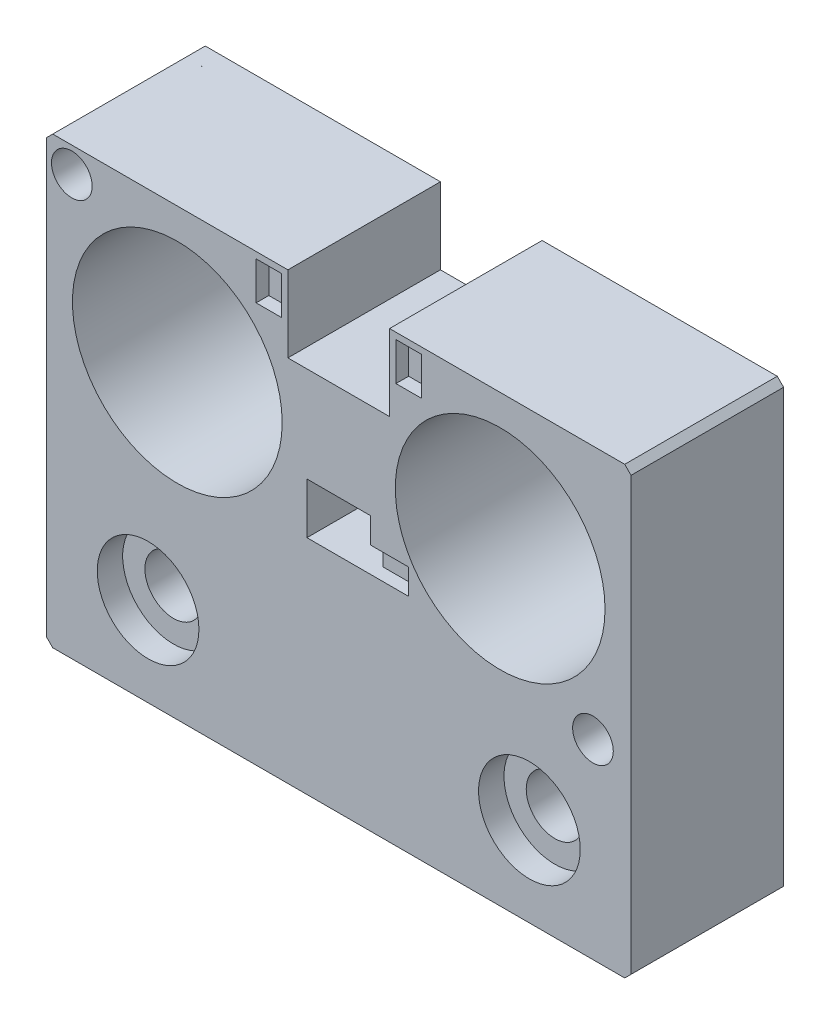
ISO-10303-21;
HEADER;
FILE_DESCRIPTION(('STEP AP214'),'2;1');
FILE_NAME('part.step','',(''),(''),'','','');
FILE_SCHEMA(('AUTOMOTIVE_DESIGN { 1 0 10303 214 1 1 1 1 }'));
ENDSEC;
DATA;
#1=APPLICATION_CONTEXT('core data for automotive mechanical design processes');
#2=APPLICATION_PROTOCOL_DEFINITION('international standard','automotive_design',2000,#1);
#3=PRODUCT_CONTEXT('',#1,'mechanical');
#4=PRODUCT('Part','Part','',(#3));
#5=PRODUCT_RELATED_PRODUCT_CATEGORY('part','',(#4));
#6=PRODUCT_DEFINITION_FORMATION('','',#4);
#7=PRODUCT_DEFINITION_CONTEXT('part definition',#1,'design');
#8=PRODUCT_DEFINITION('design','',#6,#7);
#9=PRODUCT_DEFINITION_SHAPE('','',#8);
#10=(LENGTH_UNIT() NAMED_UNIT(*) SI_UNIT(.MILLI.,.METRE.));
#11=(NAMED_UNIT(*) PLANE_ANGLE_UNIT() SI_UNIT($,.RADIAN.));
#12=(NAMED_UNIT(*) SI_UNIT($,.STERADIAN.) SOLID_ANGLE_UNIT());
#13=UNCERTAINTY_MEASURE_WITH_UNIT(LENGTH_MEASURE(1.E-05),#10,'distance_accuracy_value','');
#14=(GEOMETRIC_REPRESENTATION_CONTEXT(3) GLOBAL_UNCERTAINTY_ASSIGNED_CONTEXT((#13)) GLOBAL_UNIT_ASSIGNED_CONTEXT((#10,
#11,#12)) REPRESENTATION_CONTEXT('',''));
#15=CARTESIAN_POINT('',(0.,0.,0.));
#16=DIRECTION('',(0.,0.,1.));
#17=DIRECTION('',(1.,0.,0.));
#18=AXIS2_PLACEMENT_3D('',#15,#16,#17);
#19=CARTESIAN_POINT('',(-15.,-18.,12.));
#20=DIRECTION('',(0.,0.,-1.));
#21=DIRECTION('',(-1.,0.,0.));
#22=AXIS2_PLACEMENT_3D('',#19,#20,#21);
#23=CYLINDRICAL_SURFACE('',#22,2.25);
#24=CARTESIAN_POINT('',(-15.,-18.,0.));
#25=DIRECTION('',(0.,0.,-1.));
#26=DIRECTION('',(-1.,0.,0.));
#27=AXIS2_PLACEMENT_3D('',#24,#25,#26);
#28=CIRCLE('',#27,2.25);
#29=CARTESIAN_POINT('',(-17.25,-18.,0.));
#30=VERTEX_POINT('',#29);
#31=EDGE_CURVE('E908',#30,#30,#28,.T.);
#32=ORIENTED_EDGE('',*,*,#31,.T.);
#33=EDGE_LOOP('',(#32));
#34=FACE_BOUND('',#33,.T.);
#35=CARTESIAN_POINT('',(-15.,-18.,10.));
#36=DIRECTION('',(0.,0.,1.));
#37=DIRECTION('',(1.,0.,0.));
#38=AXIS2_PLACEMENT_3D('',#35,#36,#37);
#39=CIRCLE('',#38,2.25);
#40=CARTESIAN_POINT('',(-12.75,-18.,10.));
#41=VERTEX_POINT('',#40);
#42=EDGE_CURVE('E409',#41,#41,#39,.F.);
#43=ORIENTED_EDGE('',*,*,#42,.F.);
#44=EDGE_LOOP('',(#43));
#45=FACE_BOUND('',#44,.T.);
#46=ADVANCED_FACE('F35',(#34,#45),#23,.F.);
#47=CARTESIAN_POINT('',(15.,-18.,12.));
#48=DIRECTION('',(0.,0.,-1.));
#49=DIRECTION('',(-1.,0.,0.));
#50=AXIS2_PLACEMENT_3D('',#47,#48,#49);
#51=CYLINDRICAL_SURFACE('',#50,2.25000000000001);
#52=CARTESIAN_POINT('',(15.,-18.,0.));
#53=DIRECTION('',(0.,0.,-1.));
#54=DIRECTION('',(-1.,0.,0.));
#55=AXIS2_PLACEMENT_3D('',#52,#53,#54);
#56=CIRCLE('',#55,2.25000000000001);
#57=CARTESIAN_POINT('',(12.75,-18.,0.));
#58=VERTEX_POINT('',#57);
#59=EDGE_CURVE('E911',#58,#58,#56,.T.);
#60=ORIENTED_EDGE('',*,*,#59,.T.);
#61=EDGE_LOOP('',(#60));
#62=FACE_BOUND('',#61,.T.);
#63=CARTESIAN_POINT('',(15.,-18.,10.));
#64=DIRECTION('',(0.,0.,1.));
#65=DIRECTION('',(1.,0.,0.));
#66=AXIS2_PLACEMENT_3D('',#63,#64,#65);
#67=CIRCLE('',#66,2.25000000000001);
#68=CARTESIAN_POINT('',(17.25,-18.,10.));
#69=VERTEX_POINT('',#68);
#70=EDGE_CURVE('E406',#69,#69,#67,.F.);
#71=ORIENTED_EDGE('',*,*,#70,.F.);
#72=EDGE_LOOP('',(#71));
#73=FACE_BOUND('',#72,.T.);
#74=ADVANCED_FACE('F506',(#62,#73),#51,.F.);
#75=CARTESIAN_POINT('',(-23.,10.,12.));
#76=DIRECTION('',(0.,-1.,0.));
#77=DIRECTION('',(0.,0.,-1.));
#78=AXIS2_PLACEMENT_3D('',#75,#76,#77);
#79=PLANE('',#78);
#80=DIRECTION('',(-1.,0.,0.));
#81=VECTOR('',#80,1.);
#82=CARTESIAN_POINT('',(-23.,10.,12.));
#83=LINE('',#82,#81);
#84=CARTESIAN_POINT('',(22.5,10.,12.));
#85=VERTEX_POINT('',#84);
#86=CARTESIAN_POINT('',(4.00000000000001,10.,12.));
#87=VERTEX_POINT('',#86);
#88=EDGE_CURVE('E391',#85,#87,#83,.T.);
#89=ORIENTED_EDGE('',*,*,#88,.F.);
#90=DIRECTION('',(0.,0.,-1.));
#91=VECTOR('',#90,1.);
#92=CARTESIAN_POINT('',(22.5,10.,12.));
#93=LINE('',#92,#91);
#94=CARTESIAN_POINT('',(22.5,10.,0.));
#95=VERTEX_POINT('',#94);
#96=EDGE_CURVE('E427',#85,#95,#93,.T.);
#97=ORIENTED_EDGE('',*,*,#96,.T.);
#98=DIRECTION('',(-1.,0.,0.));
#99=VECTOR('',#98,1.);
#100=CARTESIAN_POINT('',(-23.,10.,0.));
#101=LINE('',#100,#99);
#102=CARTESIAN_POINT('',(4.00000000000001,10.,0.));
#103=VERTEX_POINT('',#102);
#104=EDGE_CURVE('E398',#95,#103,#101,.T.);
#105=ORIENTED_EDGE('',*,*,#104,.T.);
#106=DIRECTION('',(0.,0.,1.));
#107=VECTOR('',#106,1.);
#108=CARTESIAN_POINT('',(4.00000000000001,10.,0.));
#109=LINE('',#108,#107);
#110=EDGE_CURVE('E358',#103,#87,#109,.T.);
#111=ORIENTED_EDGE('',*,*,#110,.T.);
#112=EDGE_LOOP('',(#89,#97,#105,#111));
#113=FACE_BOUND('',#112,.T.);
#114=ADVANCED_FACE('F487',(#113),#79,.F.);
#115=CARTESIAN_POINT('',(23.,-10.,12.));
#116=DIRECTION('',(-1.,0.,0.));
#117=DIRECTION('',(0.,0.,1.));
#118=AXIS2_PLACEMENT_3D('',#115,#116,#117);
#119=PLANE('',#118);
#120=DIRECTION('',(0.,1.,0.));
#121=VECTOR('',#120,1.);
#122=CARTESIAN_POINT('',(23.,-10.,12.));
#123=LINE('',#122,#121);
#124=CARTESIAN_POINT('',(23.,-24.5,12.));
#125=VERTEX_POINT('',#124);
#126=CARTESIAN_POINT('',(23.,9.50000000000001,12.));
#127=VERTEX_POINT('',#126);
#128=EDGE_CURVE('E387',#125,#127,#123,.T.);
#129=ORIENTED_EDGE('',*,*,#128,.F.);
#130=DIRECTION('',(0.,0.,-1.));
#131=VECTOR('',#130,1.);
#132=CARTESIAN_POINT('',(23.,-24.5,0.));
#133=LINE('',#132,#131);
#134=CARTESIAN_POINT('',(23.,-24.5,0.));
#135=VERTEX_POINT('',#134);
#136=EDGE_CURVE('E11',#125,#135,#133,.T.);
#137=ORIENTED_EDGE('',*,*,#136,.T.);
#138=DIRECTION('',(0.,1.,0.));
#139=VECTOR('',#138,1.);
#140=CARTESIAN_POINT('',(23.,-10.,0.));
#141=LINE('',#140,#139);
#142=CARTESIAN_POINT('',(23.,9.50000000000001,0.));
#143=VERTEX_POINT('',#142);
#144=EDGE_CURVE('E378',#135,#143,#141,.T.);
#145=ORIENTED_EDGE('',*,*,#144,.T.);
#146=DIRECTION('',(0.,0.,1.));
#147=VECTOR('',#146,1.);
#148=CARTESIAN_POINT('',(23.,9.50000000000001,12.));
#149=LINE('',#148,#147);
#150=EDGE_CURVE('E430',#143,#127,#149,.T.);
#151=ORIENTED_EDGE('',*,*,#150,.T.);
#152=EDGE_LOOP('',(#129,#137,#145,#151));
#153=FACE_BOUND('',#152,.T.);
#154=ADVANCED_FACE('F498',(#153),#119,.F.);
#155=CARTESIAN_POINT('',(-3.99999999999999,10.,0.));
#156=VERTEX_POINT('',#155);
#157=CARTESIAN_POINT('',(-22.5,10.,0.));
#158=VERTEX_POINT('',#157);
#159=EDGE_CURVE('E397',#156,#158,#101,.T.);
#160=ORIENTED_EDGE('',*,*,#159,.T.);
#161=DIRECTION('',(0.,0.,1.));
#162=VECTOR('',#161,1.);
#163=CARTESIAN_POINT('',(-22.5,10.,12.));
#164=LINE('',#163,#162);
#165=CARTESIAN_POINT('',(-22.5,10.,12.));
#166=VERTEX_POINT('',#165);
#167=EDGE_CURVE('E421',#158,#166,#164,.T.);
#168=ORIENTED_EDGE('',*,*,#167,.T.);
#169=CARTESIAN_POINT('',(-3.99999999999999,10.,12.));
#170=VERTEX_POINT('',#169);
#171=EDGE_CURVE('E389',#170,#166,#83,.T.);
#172=ORIENTED_EDGE('',*,*,#171,.F.);
#173=DIRECTION('',(0.,0.,1.));
#174=VECTOR('',#173,1.);
#175=CARTESIAN_POINT('',(-3.99999999999999,10.,0.));
#176=LINE('',#175,#174);
#177=EDGE_CURVE('E371',#156,#170,#176,.T.);
#178=ORIENTED_EDGE('',*,*,#177,.F.);
#179=EDGE_LOOP('',(#160,#168,#172,#178));
#180=FACE_BOUND('',#179,.T.);
#181=ADVANCED_FACE('F469',(#180),#79,.F.);
#182=CARTESIAN_POINT('',(-23.,-10.,12.));
#183=DIRECTION('',(1.,0.,0.));
#184=DIRECTION('',(0.,0.,-1.));
#185=AXIS2_PLACEMENT_3D('',#182,#183,#184);
#186=PLANE('',#185);
#187=DIRECTION('',(0.,-1.,0.));
#188=VECTOR('',#187,1.);
#189=CARTESIAN_POINT('',(-23.,-10.,0.));
#190=LINE('',#189,#188);
#191=CARTESIAN_POINT('',(-23.,9.5,0.));
#192=VERTEX_POINT('',#191);
#193=CARTESIAN_POINT('',(-23.,-24.5,0.));
#194=VERTEX_POINT('',#193);
#195=EDGE_CURVE('E390',#192,#194,#190,.T.);
#196=ORIENTED_EDGE('',*,*,#195,.T.);
#197=DIRECTION('',(0.,0.,1.));
#198=VECTOR('',#197,1.);
#199=CARTESIAN_POINT('',(-23.,-24.5,12.));
#200=LINE('',#199,#198);
#201=CARTESIAN_POINT('',(-23.,-24.5,12.));
#202=VERTEX_POINT('',#201);
#203=EDGE_CURVE('E58',#194,#202,#200,.T.);
#204=ORIENTED_EDGE('',*,*,#203,.T.);
#205=DIRECTION('',(0.,-1.,0.));
#206=VECTOR('',#205,1.);
#207=CARTESIAN_POINT('',(-23.,-10.,12.));
#208=LINE('',#207,#206);
#209=CARTESIAN_POINT('',(-23.,9.5,12.));
#210=VERTEX_POINT('',#209);
#211=EDGE_CURVE('E393',#210,#202,#208,.T.);
#212=ORIENTED_EDGE('',*,*,#211,.F.);
#213=DIRECTION('',(0.,0.,-1.));
#214=VECTOR('',#213,1.);
#215=CARTESIAN_POINT('',(-23.,9.5,12.));
#216=LINE('',#215,#214);
#217=EDGE_CURVE('E395',#210,#192,#216,.T.);
#218=ORIENTED_EDGE('',*,*,#217,.T.);
#219=EDGE_LOOP('',(#196,#204,#212,#218));
#220=FACE_BOUND('',#219,.T.);
#221=ADVANCED_FACE('F459',(#220),#186,.F.);
#222=CARTESIAN_POINT('',(0.,0.,12.));
#223=DIRECTION('',(0.,0.,-1.));
#224=DIRECTION('',(-1.,0.,0.));
#225=AXIS2_PLACEMENT_3D('',#222,#223,#224);
#226=PLANE('',#225);
#227=CARTESIAN_POINT('',(-15.,-18.,12.));
#228=DIRECTION('',(0.,0.,1.));
#229=DIRECTION('',(1.,0.,0.));
#230=AXIS2_PLACEMENT_3D('',#227,#228,#229);
#231=CIRCLE('',#230,4.);
#232=CARTESIAN_POINT('',(-11.,-18.,12.));
#233=VERTEX_POINT('',#232);
#234=EDGE_CURVE('E895',#233,#233,#231,.T.);
#235=ORIENTED_EDGE('',*,*,#234,.F.);
#236=EDGE_LOOP('',(#235));
#237=FACE_BOUND('',#236,.T.);
#238=CARTESIAN_POINT('',(15.,-18.,12.));
#239=DIRECTION('',(0.,0.,1.));
#240=DIRECTION('',(1.,0.,0.));
#241=AXIS2_PLACEMENT_3D('',#238,#239,#240);
#242=CIRCLE('',#241,4.);
#243=CARTESIAN_POINT('',(19.,-18.,12.));
#244=VERTEX_POINT('',#243);
#245=EDGE_CURVE('E900',#244,#244,#242,.T.);
#246=ORIENTED_EDGE('',*,*,#245,.F.);
#247=EDGE_LOOP('',(#246));
#248=FACE_BOUND('',#247,.T.);
#249=CARTESIAN_POINT('',(20.,-10.,12.));
#250=DIRECTION('',(0.,0.,1.));
#251=DIRECTION('',(1.,0.,0.));
#252=AXIS2_PLACEMENT_3D('',#249,#250,#251);
#253=CIRCLE('',#252,1.6);
#254=CARTESIAN_POINT('',(21.6,-10.,12.));
#255=VERTEX_POINT('',#254);
#256=EDGE_CURVE('E413',#255,#255,#253,.T.);
#257=ORIENTED_EDGE('',*,*,#256,.F.);
#258=EDGE_LOOP('',(#257));
#259=FACE_BOUND('',#258,.T.);
#260=CARTESIAN_POINT('',(-21.,8.,12.));
#261=DIRECTION('',(0.,0.,1.));
#262=DIRECTION('',(1.,0.,0.));
#263=AXIS2_PLACEMENT_3D('',#260,#261,#262);
#264=CIRCLE('',#263,1.6);
#265=CARTESIAN_POINT('',(-19.4,8.,12.));
#266=VERTEX_POINT('',#265);
#267=EDGE_CURVE('E405',#266,#266,#264,.T.);
#268=ORIENTED_EDGE('',*,*,#267,.F.);
#269=EDGE_LOOP('',(#268));
#270=FACE_BOUND('',#269,.T.);
#271=DIRECTION('',(1.,0.,0.));
#272=VECTOR('',#271,1.);
#273=CARTESIAN_POINT('',(-4.5,6.5,12.));
#274=LINE('',#273,#272);
#275=CARTESIAN_POINT('',(-6.5,6.5,12.));
#276=VERTEX_POINT('',#275);
#277=CARTESIAN_POINT('',(-4.5,6.5,12.));
#278=VERTEX_POINT('',#277);
#279=EDGE_CURVE('E270',#276,#278,#274,.T.);
#280=ORIENTED_EDGE('',*,*,#279,.F.);
#281=DIRECTION('',(0.,-1.,0.));
#282=VECTOR('',#281,1.);
#283=CARTESIAN_POINT('',(-6.5,9.5,12.));
#284=LINE('',#283,#282);
#285=CARTESIAN_POINT('',(-6.5,9.5,12.));
#286=VERTEX_POINT('',#285);
#287=EDGE_CURVE('E268',#286,#276,#284,.T.);
#288=ORIENTED_EDGE('',*,*,#287,.F.);
#289=DIRECTION('',(-1.,0.,0.));
#290=VECTOR('',#289,1.);
#291=CARTESIAN_POINT('',(-4.5,9.5,12.));
#292=LINE('',#291,#290);
#293=CARTESIAN_POINT('',(-4.5,9.5,12.));
#294=VERTEX_POINT('',#293);
#295=EDGE_CURVE('E258',#294,#286,#292,.T.);
#296=ORIENTED_EDGE('',*,*,#295,.F.);
#297=DIRECTION('',(0.,1.,0.));
#298=VECTOR('',#297,1.);
#299=CARTESIAN_POINT('',(-4.5,9.5,12.));
#300=LINE('',#299,#298);
#301=EDGE_CURVE('E274',#278,#294,#300,.T.);
#302=ORIENTED_EDGE('',*,*,#301,.F.);
#303=EDGE_LOOP('',(#280,#288,#296,#302));
#304=FACE_BOUND('',#303,.T.);
#305=DIRECTION('',(1.,0.,0.));
#306=VECTOR('',#305,1.);
#307=CARTESIAN_POINT('',(6.50000000000001,6.5,12.));
#308=LINE('',#307,#306);
#309=CARTESIAN_POINT('',(4.50000000000001,6.5,12.));
#310=VERTEX_POINT('',#309);
#311=CARTESIAN_POINT('',(6.50000000000001,6.5,12.));
#312=VERTEX_POINT('',#311);
#313=EDGE_CURVE('E302',#310,#312,#308,.T.);
#314=ORIENTED_EDGE('',*,*,#313,.F.);
#315=DIRECTION('',(0.,-1.,0.));
#316=VECTOR('',#315,1.);
#317=CARTESIAN_POINT('',(4.50000000000001,9.5,12.));
#318=LINE('',#317,#316);
#319=CARTESIAN_POINT('',(4.50000000000001,9.5,12.));
#320=VERTEX_POINT('',#319);
#321=EDGE_CURVE('E300',#320,#310,#318,.T.);
#322=ORIENTED_EDGE('',*,*,#321,.F.);
#323=DIRECTION('',(-1.,0.,0.));
#324=VECTOR('',#323,1.);
#325=CARTESIAN_POINT('',(6.50000000000001,9.5,12.));
#326=LINE('',#325,#324);
#327=CARTESIAN_POINT('',(6.50000000000001,9.5,12.));
#328=VERTEX_POINT('',#327);
#329=EDGE_CURVE('E290',#328,#320,#326,.T.);
#330=ORIENTED_EDGE('',*,*,#329,.F.);
#331=DIRECTION('',(0.,1.,0.));
#332=VECTOR('',#331,1.);
#333=CARTESIAN_POINT('',(6.50000000000001,9.5,12.));
#334=LINE('',#333,#332);
#335=EDGE_CURVE('E306',#312,#328,#334,.T.);
#336=ORIENTED_EDGE('',*,*,#335,.F.);
#337=EDGE_LOOP('',(#314,#322,#330,#336));
#338=FACE_BOUND('',#337,.T.);
#339=DIRECTION('',(0.,1.,0.));
#340=VECTOR('',#339,1.);
#341=CARTESIAN_POINT('',(2.5,-3.5,12.));
#342=LINE('',#341,#340);
#343=CARTESIAN_POINT('',(2.5,-5.5,12.));
#344=VERTEX_POINT('',#343);
#345=CARTESIAN_POINT('',(2.5,-3.5,12.));
#346=VERTEX_POINT('',#345);
#347=EDGE_CURVE('E252',#344,#346,#342,.T.);
#348=ORIENTED_EDGE('',*,*,#347,.F.);
#349=DIRECTION('',(-1.,0.,0.));
#350=VECTOR('',#349,1.);
#351=CARTESIAN_POINT('',(2.5,-5.5,12.));
#352=LINE('',#351,#350);
#353=CARTESIAN_POINT('',(5.5,-5.5,12.));
#354=VERTEX_POINT('',#353);
#355=EDGE_CURVE('E240',#354,#344,#352,.T.);
#356=ORIENTED_EDGE('',*,*,#355,.F.);
#357=DIRECTION('',(0.,1.,0.));
#358=VECTOR('',#357,1.);
#359=CARTESIAN_POINT('',(5.5,-7.5,12.));
#360=LINE('',#359,#358);
#361=CARTESIAN_POINT('',(5.5,-7.5,12.));
#362=VERTEX_POINT('',#361);
#363=EDGE_CURVE('E245',#362,#354,#360,.T.);
#364=ORIENTED_EDGE('',*,*,#363,.F.);
#365=DIRECTION('',(1.,0.,0.));
#366=VECTOR('',#365,1.);
#367=CARTESIAN_POINT('',(-2.5,-7.5,12.));
#368=LINE('',#367,#366);
#369=CARTESIAN_POINT('',(-2.5,-7.5,12.));
#370=VERTEX_POINT('',#369);
#371=EDGE_CURVE('E222',#370,#362,#368,.T.);
#372=ORIENTED_EDGE('',*,*,#371,.F.);
#373=DIRECTION('',(0.,-1.,0.));
#374=VECTOR('',#373,1.);
#375=CARTESIAN_POINT('',(-2.5,-3.5,12.));
#376=LINE('',#375,#374);
#377=CARTESIAN_POINT('',(-2.5,-3.5,12.));
#378=VERTEX_POINT('',#377);
#379=EDGE_CURVE('E335',#378,#370,#376,.T.);
#380=ORIENTED_EDGE('',*,*,#379,.F.);
#381=DIRECTION('',(-1.,0.,0.));
#382=VECTOR('',#381,1.);
#383=CARTESIAN_POINT('',(-2.5,-3.5,12.));
#384=LINE('',#383,#382);
#385=EDGE_CURVE('E332',#346,#378,#384,.T.);
#386=ORIENTED_EDGE('',*,*,#385,.F.);
#387=EDGE_LOOP('',(#348,#356,#364,#372,#380,#386));
#388=FACE_BOUND('',#387,.T.);
#389=CARTESIAN_POINT('',(-12.7,-0.650000000000001,12.));
#390=DIRECTION('',(0.,0.,1.));
#391=DIRECTION('',(1.,0.,0.));
#392=AXIS2_PLACEMENT_3D('',#389,#390,#391);
#393=CIRCLE('',#392,8.25);
#394=CARTESIAN_POINT('',(-4.45,-0.650000000000001,12.));
#395=VERTEX_POINT('',#394);
#396=EDGE_CURVE('E379',#395,#395,#393,.T.);
#397=ORIENTED_EDGE('',*,*,#396,.F.);
#398=EDGE_LOOP('',(#397));
#399=FACE_BOUND('',#398,.T.);
#400=CARTESIAN_POINT('',(12.7,-0.650000000000001,12.));
#401=DIRECTION('',(0.,0.,1.));
#402=DIRECTION('',(1.,0.,0.));
#403=AXIS2_PLACEMENT_3D('',#400,#401,#402);
#404=CIRCLE('',#403,8.25);
#405=CARTESIAN_POINT('',(20.95,-0.650000000000001,12.));
#406=VERTEX_POINT('',#405);
#407=EDGE_CURVE('E368',#406,#406,#404,.T.);
#408=ORIENTED_EDGE('',*,*,#407,.F.);
#409=EDGE_LOOP('',(#408));
#410=FACE_BOUND('',#409,.T.);
#411=ORIENTED_EDGE('',*,*,#211,.T.);
#412=DIRECTION('',(0.707106781186543,-0.707106781186552,0.));
#413=VECTOR('',#412,1.);
#414=CARTESIAN_POINT('',(-22.5,-25.,12.));
#415=LINE('',#414,#413);
#416=CARTESIAN_POINT('',(-22.5,-25.,12.));
#417=VERTEX_POINT('',#416);
#418=EDGE_CURVE('E43',#202,#417,#415,.T.);
#419=ORIENTED_EDGE('',*,*,#418,.T.);
#420=DIRECTION('',(-1.,0.,0.));
#421=VECTOR('',#420,1.);
#422=CARTESIAN_POINT('',(-23.,-25.,12.));
#423=LINE('',#422,#421);
#424=CARTESIAN_POINT('',(22.5,-25.,12.));
#425=VERTEX_POINT('',#424);
#426=EDGE_CURVE('E303',#425,#417,#423,.T.);
#427=ORIENTED_EDGE('',*,*,#426,.F.);
#428=DIRECTION('',(0.707106781186543,0.707106781186552,0.));
#429=VECTOR('',#428,1.);
#430=CARTESIAN_POINT('',(22.5,-25.,12.));
#431=LINE('',#430,#429);
#432=EDGE_CURVE('E50',#425,#125,#431,.T.);
#433=ORIENTED_EDGE('',*,*,#432,.T.);
#434=ORIENTED_EDGE('',*,*,#128,.T.);
#435=DIRECTION('',(0.707106781186543,-0.707106781186552,0.));
#436=VECTOR('',#435,1.);
#437=CARTESIAN_POINT('',(22.5,10.,12.));
#438=LINE('',#437,#436);
#439=EDGE_CURVE('E423',#127,#85,#438,.F.);
#440=ORIENTED_EDGE('',*,*,#439,.T.);
#441=ORIENTED_EDGE('',*,*,#88,.T.);
#442=DIRECTION('',(0.,1.,0.));
#443=VECTOR('',#442,1.);
#444=CARTESIAN_POINT('',(4.00000000000001,4.,12.));
#445=LINE('',#444,#443);
#446=CARTESIAN_POINT('',(4.00000000000001,4.,12.));
#447=VERTEX_POINT('',#446);
#448=EDGE_CURVE('E341',#447,#87,#445,.T.);
#449=ORIENTED_EDGE('',*,*,#448,.F.);
#450=DIRECTION('',(1.,0.,0.));
#451=VECTOR('',#450,1.);
#452=CARTESIAN_POINT('',(-3.99999999999999,4.,12.));
#453=LINE('',#452,#451);
#454=CARTESIAN_POINT('',(-3.99999999999999,4.,12.));
#455=VERTEX_POINT('',#454);
#456=EDGE_CURVE('E352',#455,#447,#453,.T.);
#457=ORIENTED_EDGE('',*,*,#456,.F.);
#458=DIRECTION('',(0.,-1.,0.));
#459=VECTOR('',#458,1.);
#460=CARTESIAN_POINT('',(-3.99999999999999,4.,12.));
#461=LINE('',#460,#459);
#462=EDGE_CURVE('E361',#170,#455,#461,.T.);
#463=ORIENTED_EDGE('',*,*,#462,.F.);
#464=ORIENTED_EDGE('',*,*,#171,.T.);
#465=DIRECTION('',(0.707106781186548,0.707106781186548,0.));
#466=VECTOR('',#465,1.);
#467=CARTESIAN_POINT('',(-23.,9.5,12.));
#468=LINE('',#467,#466);
#469=EDGE_CURVE('E425',#166,#210,#468,.F.);
#470=ORIENTED_EDGE('',*,*,#469,.T.);
#471=EDGE_LOOP('',(#411,#419,#427,#433,#434,#440,#441,#449,#457,#463,#464,#470));
#472=FACE_BOUND('',#471,.T.);
#473=ADVANCED_FACE('F446',(#237,#248,#259,#270,#304,#338,#388,#399,#410,#472),#226,.F.);
#474=CARTESIAN_POINT('',(0.,0.,0.));
#475=DIRECTION('',(0.,0.,-1.));
#476=DIRECTION('',(-1.,0.,0.));
#477=AXIS2_PLACEMENT_3D('',#474,#475,#476);
#478=PLANE('',#477);
#479=CARTESIAN_POINT('',(20.,-10.,0.));
#480=DIRECTION('',(0.,0.,1.));
#481=DIRECTION('',(1.,0.,0.));
#482=AXIS2_PLACEMENT_3D('',#479,#480,#481);
#483=CIRCLE('',#482,1.6);
#484=CARTESIAN_POINT('',(21.6,-10.,0.));
#485=VERTEX_POINT('',#484);
#486=EDGE_CURVE('E905',#485,#485,#483,.T.);
#487=ORIENTED_EDGE('',*,*,#486,.T.);
#488=EDGE_LOOP('',(#487));
#489=FACE_BOUND('',#488,.T.);
#490=ORIENTED_EDGE('',*,*,#59,.F.);
#491=EDGE_LOOP('',(#490));
#492=FACE_BOUND('',#491,.T.);
#493=ORIENTED_EDGE('',*,*,#31,.F.);
#494=EDGE_LOOP('',(#493));
#495=FACE_BOUND('',#494,.T.);
#496=CARTESIAN_POINT('',(-21.,8.,0.));
#497=DIRECTION('',(0.,0.,-1.));
#498=DIRECTION('',(-1.,0.,0.));
#499=AXIS2_PLACEMENT_3D('',#496,#497,#498);
#500=CIRCLE('',#499,1.6);
#501=CARTESIAN_POINT('',(-22.6,8.,0.));
#502=VERTEX_POINT('',#501);
#503=EDGE_CURVE('E401',#502,#502,#500,.T.);
#504=ORIENTED_EDGE('',*,*,#503,.F.);
#505=EDGE_LOOP('',(#504));
#506=FACE_BOUND('',#505,.T.);
#507=DIRECTION('',(0.,1.,0.));
#508=VECTOR('',#507,1.);
#509=CARTESIAN_POINT('',(2.5,-3.5,0.));
#510=LINE('',#509,#508);
#511=CARTESIAN_POINT('',(2.5,-7.5,0.));
#512=VERTEX_POINT('',#511);
#513=CARTESIAN_POINT('',(2.5,-3.5,0.));
#514=VERTEX_POINT('',#513);
#515=EDGE_CURVE('E318',#512,#514,#510,.T.);
#516=ORIENTED_EDGE('',*,*,#515,.T.);
#517=DIRECTION('',(-1.,0.,0.));
#518=VECTOR('',#517,1.);
#519=CARTESIAN_POINT('',(-2.5,-3.5,0.));
#520=LINE('',#519,#518);
#521=CARTESIAN_POINT('',(-2.5,-3.5,0.));
#522=VERTEX_POINT('',#521);
#523=EDGE_CURVE('E321',#514,#522,#520,.T.);
#524=ORIENTED_EDGE('',*,*,#523,.T.);
#525=DIRECTION('',(0.,-1.,0.));
#526=VECTOR('',#525,1.);
#527=CARTESIAN_POINT('',(-2.5,-3.5,0.));
#528=LINE('',#527,#526);
#529=CARTESIAN_POINT('',(-2.5,-7.5,0.));
#530=VERTEX_POINT('',#529);
#531=EDGE_CURVE('E324',#522,#530,#528,.T.);
#532=ORIENTED_EDGE('',*,*,#531,.T.);
#533=DIRECTION('',(1.,0.,0.));
#534=VECTOR('',#533,1.);
#535=CARTESIAN_POINT('',(-2.5,-7.5,0.));
#536=LINE('',#535,#534);
#537=EDGE_CURVE('E327',#530,#512,#536,.T.);
#538=ORIENTED_EDGE('',*,*,#537,.T.);
#539=EDGE_LOOP('',(#516,#524,#532,#538));
#540=FACE_BOUND('',#539,.T.);
#541=DIRECTION('',(1.,0.,0.));
#542=VECTOR('',#541,1.);
#543=CARTESIAN_POINT('',(-23.,-25.,0.));
#544=LINE('',#543,#542);
#545=CARTESIAN_POINT('',(-22.5,-25.,0.));
#546=VERTEX_POINT('',#545);
#547=CARTESIAN_POINT('',(22.5,-25.,0.));
#548=VERTEX_POINT('',#547);
#549=EDGE_CURVE('E404',#546,#548,#544,.T.);
#550=ORIENTED_EDGE('',*,*,#549,.F.);
#551=DIRECTION('',(-0.707106781186543,0.707106781186552,0.));
#552=VECTOR('',#551,1.);
#553=CARTESIAN_POINT('',(-23.7500000000002,-23.7499999999998,0.));
#554=LINE('',#553,#552);
#555=EDGE_CURVE('E441',#546,#194,#554,.T.);
#556=ORIENTED_EDGE('',*,*,#555,.T.);
#557=ORIENTED_EDGE('',*,*,#195,.F.);
#558=DIRECTION('',(-0.707106781186548,-0.707106781186548,0.));
#559=VECTOR('',#558,1.);
#560=CARTESIAN_POINT('',(-16.25,16.25,0.));
#561=LINE('',#560,#559);
#562=EDGE_CURVE('E419',#192,#158,#561,.F.);
#563=ORIENTED_EDGE('',*,*,#562,.T.);
#564=ORIENTED_EDGE('',*,*,#159,.F.);
#565=DIRECTION('',(0.,-1.,0.));
#566=VECTOR('',#565,1.);
#567=CARTESIAN_POINT('',(-3.99999999999999,4.,0.));
#568=LINE('',#567,#566);
#569=CARTESIAN_POINT('',(-3.99999999999999,4.,0.));
#570=VERTEX_POINT('',#569);
#571=EDGE_CURVE('E351',#156,#570,#568,.T.);
#572=ORIENTED_EDGE('',*,*,#571,.T.);
#573=DIRECTION('',(1.,0.,0.));
#574=VECTOR('',#573,1.);
#575=CARTESIAN_POINT('',(-3.99999999999999,4.,0.));
#576=LINE('',#575,#574);
#577=CARTESIAN_POINT('',(4.00000000000001,4.,0.));
#578=VERTEX_POINT('',#577);
#579=EDGE_CURVE('E355',#570,#578,#576,.T.);
#580=ORIENTED_EDGE('',*,*,#579,.T.);
#581=DIRECTION('',(0.,1.,0.));
#582=VECTOR('',#581,1.);
#583=CARTESIAN_POINT('',(4.00000000000001,4.,0.));
#584=LINE('',#583,#582);
#585=EDGE_CURVE('E348',#578,#103,#584,.T.);
#586=ORIENTED_EDGE('',*,*,#585,.T.);
#587=ORIENTED_EDGE('',*,*,#104,.F.);
#588=DIRECTION('',(-0.707106781186543,0.707106781186552,0.));
#589=VECTOR('',#588,1.);
#590=CARTESIAN_POINT('',(16.2500000000002,16.2499999999999,0.));
#591=LINE('',#590,#589);
#592=EDGE_CURVE('E416',#95,#143,#591,.F.);
#593=ORIENTED_EDGE('',*,*,#592,.T.);
#594=ORIENTED_EDGE('',*,*,#144,.F.);
#595=DIRECTION('',(-0.707106781186543,-0.707106781186552,0.));
#596=VECTOR('',#595,1.);
#597=CARTESIAN_POINT('',(23.7500000000002,-23.7499999999998,0.));
#598=LINE('',#597,#596);
#599=EDGE_CURVE('E439',#135,#548,#598,.T.);
#600=ORIENTED_EDGE('',*,*,#599,.T.);
#601=EDGE_LOOP('',(#550,#556,#557,#563,#564,#572,#580,#586,#587,#593,#594,#600));
#602=FACE_BOUND('',#601,.T.);
#603=CARTESIAN_POINT('',(-12.7,-0.650000000000001,0.));
#604=DIRECTION('',(0.,0.,1.));
#605=DIRECTION('',(1.,0.,0.));
#606=AXIS2_PLACEMENT_3D('',#603,#604,#605);
#607=CIRCLE('',#606,8.25);
#608=CARTESIAN_POINT('',(-4.45,-0.650000000000001,0.));
#609=VERTEX_POINT('',#608);
#610=EDGE_CURVE('E375',#609,#609,#607,.T.);
#611=ORIENTED_EDGE('',*,*,#610,.T.);
#612=EDGE_LOOP('',(#611));
#613=FACE_BOUND('',#612,.T.);
#614=CARTESIAN_POINT('',(12.7,-0.650000000000001,0.));
#615=DIRECTION('',(0.,0.,1.));
#616=DIRECTION('',(1.,0.,0.));
#617=AXIS2_PLACEMENT_3D('',#614,#615,#616);
#618=CIRCLE('',#617,8.25);
#619=CARTESIAN_POINT('',(20.95,-0.650000000000001,0.));
#620=VERTEX_POINT('',#619);
#621=EDGE_CURVE('E382',#620,#620,#618,.T.);
#622=ORIENTED_EDGE('',*,*,#621,.T.);
#623=EDGE_LOOP('',(#622));
#624=FACE_BOUND('',#623,.T.);
#625=ADVANCED_FACE('F457',(#489,#492,#495,#506,#540,#602,#613,#624),#478,.T.);
#626=CARTESIAN_POINT('',(12.7,-0.650000000000001,0.));
#627=DIRECTION('',(0.,0.,1.));
#628=DIRECTION('',(1.,0.,0.));
#629=AXIS2_PLACEMENT_3D('',#626,#627,#628);
#630=CYLINDRICAL_SURFACE('',#629,8.25);
#631=ORIENTED_EDGE('',*,*,#621,.F.);
#632=EDGE_LOOP('',(#631));
#633=FACE_BOUND('',#632,.T.);
#634=ORIENTED_EDGE('',*,*,#407,.T.);
#635=EDGE_LOOP('',(#634));
#636=FACE_BOUND('',#635,.T.);
#637=ADVANCED_FACE('F598',(#633,#636),#630,.F.);
#638=CARTESIAN_POINT('',(-12.7,-0.650000000000001,0.));
#639=DIRECTION('',(0.,0.,1.));
#640=DIRECTION('',(1.,0.,0.));
#641=AXIS2_PLACEMENT_3D('',#638,#639,#640);
#642=CYLINDRICAL_SURFACE('',#641,8.25);
#643=ORIENTED_EDGE('',*,*,#610,.F.);
#644=EDGE_LOOP('',(#643));
#645=FACE_BOUND('',#644,.T.);
#646=ORIENTED_EDGE('',*,*,#396,.T.);
#647=EDGE_LOOP('',(#646));
#648=FACE_BOUND('',#647,.T.);
#649=ADVANCED_FACE('F595',(#645,#648),#642,.F.);
#650=CARTESIAN_POINT('',(4.00000000000001,4.,0.));
#651=DIRECTION('',(1.,0.,0.));
#652=DIRECTION('',(0.,0.,-1.));
#653=AXIS2_PLACEMENT_3D('',#650,#651,#652);
#654=PLANE('',#653);
#655=ORIENTED_EDGE('',*,*,#448,.T.);
#656=ORIENTED_EDGE('',*,*,#110,.F.);
#657=ORIENTED_EDGE('',*,*,#585,.F.);
#658=DIRECTION('',(0.,0.,1.));
#659=VECTOR('',#658,1.);
#660=CARTESIAN_POINT('',(4.00000000000001,4.,0.));
#661=LINE('',#660,#659);
#662=EDGE_CURVE('E366',#578,#447,#661,.T.);
#663=ORIENTED_EDGE('',*,*,#662,.T.);
#664=EDGE_LOOP('',(#655,#656,#657,#663));
#665=FACE_BOUND('',#664,.T.);
#666=ADVANCED_FACE('F484',(#665),#654,.F.);
#667=CARTESIAN_POINT('',(-3.99999999999999,4.,0.));
#668=DIRECTION('',(0.,-1.,0.));
#669=DIRECTION('',(0.,0.,-1.));
#670=AXIS2_PLACEMENT_3D('',#667,#668,#669);
#671=PLANE('',#670);
#672=ORIENTED_EDGE('',*,*,#456,.T.);
#673=ORIENTED_EDGE('',*,*,#662,.F.);
#674=ORIENTED_EDGE('',*,*,#579,.F.);
#675=DIRECTION('',(0.,0.,1.));
#676=VECTOR('',#675,1.);
#677=CARTESIAN_POINT('',(-3.99999999999999,4.,0.));
#678=LINE('',#677,#676);
#679=EDGE_CURVE('E369',#570,#455,#678,.T.);
#680=ORIENTED_EDGE('',*,*,#679,.T.);
#681=EDGE_LOOP('',(#672,#673,#674,#680));
#682=FACE_BOUND('',#681,.T.);
#683=ADVANCED_FACE('F479',(#682),#671,.F.);
#684=CARTESIAN_POINT('',(-3.99999999999999,4.,0.));
#685=DIRECTION('',(-1.,0.,0.));
#686=DIRECTION('',(0.,0.,1.));
#687=AXIS2_PLACEMENT_3D('',#684,#685,#686);
#688=PLANE('',#687);
#689=ORIENTED_EDGE('',*,*,#462,.T.);
#690=ORIENTED_EDGE('',*,*,#679,.F.);
#691=ORIENTED_EDGE('',*,*,#571,.F.);
#692=ORIENTED_EDGE('',*,*,#177,.T.);
#693=EDGE_LOOP('',(#689,#690,#691,#692));
#694=FACE_BOUND('',#693,.T.);
#695=ADVANCED_FACE('F474',(#694),#688,.F.);
#696=CARTESIAN_POINT('',(2.5,-3.5,0.));
#697=DIRECTION('',(1.,0.,0.));
#698=DIRECTION('',(0.,1.,0.));
#699=AXIS2_PLACEMENT_3D('',#696,#697,#698);
#700=PLANE('',#699);
#701=DIRECTION('',(0.,-1.,0.));
#702=VECTOR('',#701,1.);
#703=CARTESIAN_POINT('',(2.5,-7.5,11.));
#704=LINE('',#703,#702);
#705=CARTESIAN_POINT('',(2.5,-5.5,11.));
#706=VERTEX_POINT('',#705);
#707=CARTESIAN_POINT('',(2.5,-7.5,11.));
#708=VERTEX_POINT('',#707);
#709=EDGE_CURVE('E238',#706,#708,#704,.T.);
#710=ORIENTED_EDGE('',*,*,#709,.F.);
#711=DIRECTION('',(0.,0.,1.));
#712=VECTOR('',#711,1.);
#713=CARTESIAN_POINT('',(2.5,-5.5,11.));
#714=LINE('',#713,#712);
#715=EDGE_CURVE('E249',#706,#344,#714,.T.);
#716=ORIENTED_EDGE('',*,*,#715,.T.);
#717=ORIENTED_EDGE('',*,*,#347,.T.);
#718=DIRECTION('',(0.,0.,1.));
#719=VECTOR('',#718,1.);
#720=CARTESIAN_POINT('',(2.5,-3.5,0.));
#721=LINE('',#720,#719);
#722=EDGE_CURVE('E330',#514,#346,#721,.T.);
#723=ORIENTED_EDGE('',*,*,#722,.F.);
#724=ORIENTED_EDGE('',*,*,#515,.F.);
#725=DIRECTION('',(0.,0.,1.));
#726=VECTOR('',#725,1.);
#727=CARTESIAN_POINT('',(2.5,-7.5,0.));
#728=LINE('',#727,#726);
#729=EDGE_CURVE('E339',#512,#708,#728,.T.);
#730=ORIENTED_EDGE('',*,*,#729,.T.);
#731=EDGE_LOOP('',(#710,#716,#717,#723,#724,#730));
#732=FACE_BOUND('',#731,.T.);
#733=ADVANCED_FACE('F579',(#732),#700,.F.);
#734=CARTESIAN_POINT('',(-2.5,-7.5,0.));
#735=DIRECTION('',(0.,-1.,0.));
#736=DIRECTION('',(0.,0.,-1.));
#737=AXIS2_PLACEMENT_3D('',#734,#735,#736);
#738=PLANE('',#737);
#739=ORIENTED_EDGE('',*,*,#371,.T.);
#740=DIRECTION('',(0.,0.,1.));
#741=VECTOR('',#740,1.);
#742=CARTESIAN_POINT('',(5.5,-7.5,11.));
#743=LINE('',#742,#741);
#744=CARTESIAN_POINT('',(5.5,-7.5,11.));
#745=VERTEX_POINT('',#744);
#746=EDGE_CURVE('E215',#745,#362,#743,.T.);
#747=ORIENTED_EDGE('',*,*,#746,.F.);
#748=DIRECTION('',(1.,0.,0.));
#749=VECTOR('',#748,1.);
#750=CARTESIAN_POINT('',(2.5,-7.5,11.));
#751=LINE('',#750,#749);
#752=EDGE_CURVE('E219',#708,#745,#751,.T.);
#753=ORIENTED_EDGE('',*,*,#752,.F.);
#754=ORIENTED_EDGE('',*,*,#729,.F.);
#755=ORIENTED_EDGE('',*,*,#537,.F.);
#756=DIRECTION('',(0.,0.,1.));
#757=VECTOR('',#756,1.);
#758=CARTESIAN_POINT('',(-2.5,-7.5,0.));
#759=LINE('',#758,#757);
#760=EDGE_CURVE('E342',#530,#370,#759,.T.);
#761=ORIENTED_EDGE('',*,*,#760,.T.);
#762=EDGE_LOOP('',(#739,#747,#753,#754,#755,#761));
#763=FACE_BOUND('',#762,.T.);
#764=ADVANCED_FACE('F217',(#763),#738,.F.);
#765=CARTESIAN_POINT('',(-2.5,-3.5,0.));
#766=DIRECTION('',(-1.,0.,0.));
#767=DIRECTION('',(0.,-1.,0.));
#768=AXIS2_PLACEMENT_3D('',#765,#766,#767);
#769=PLANE('',#768);
#770=ORIENTED_EDGE('',*,*,#379,.T.);
#771=ORIENTED_EDGE('',*,*,#760,.F.);
#772=ORIENTED_EDGE('',*,*,#531,.F.);
#773=DIRECTION('',(0.,0.,1.));
#774=VECTOR('',#773,1.);
#775=CARTESIAN_POINT('',(-2.5,-3.5,0.));
#776=LINE('',#775,#774);
#777=EDGE_CURVE('E344',#522,#378,#776,.T.);
#778=ORIENTED_EDGE('',*,*,#777,.T.);
#779=EDGE_LOOP('',(#770,#771,#772,#778));
#780=FACE_BOUND('',#779,.T.);
#781=ADVANCED_FACE('F578',(#780),#769,.F.);
#782=CARTESIAN_POINT('',(-2.5,-3.5,0.));
#783=DIRECTION('',(0.,1.,0.));
#784=DIRECTION('',(0.,0.,1.));
#785=AXIS2_PLACEMENT_3D('',#782,#783,#784);
#786=PLANE('',#785);
#787=ORIENTED_EDGE('',*,*,#385,.T.);
#788=ORIENTED_EDGE('',*,*,#777,.F.);
#789=ORIENTED_EDGE('',*,*,#523,.F.);
#790=ORIENTED_EDGE('',*,*,#722,.T.);
#791=EDGE_LOOP('',(#787,#788,#789,#790));
#792=FACE_BOUND('',#791,.T.);
#793=ADVANCED_FACE('F534',(#792),#786,.F.);
#794=CARTESIAN_POINT('',(2.5,-5.5,11.));
#795=DIRECTION('',(0.,1.,0.));
#796=DIRECTION('',(0.,0.,1.));
#797=AXIS2_PLACEMENT_3D('',#794,#795,#796);
#798=PLANE('',#797);
#799=ORIENTED_EDGE('',*,*,#355,.T.);
#800=ORIENTED_EDGE('',*,*,#715,.F.);
#801=DIRECTION('',(-1.,0.,0.));
#802=VECTOR('',#801,1.);
#803=CARTESIAN_POINT('',(2.5,-5.5,11.));
#804=LINE('',#803,#802);
#805=CARTESIAN_POINT('',(5.5,-5.5,11.));
#806=VERTEX_POINT('',#805);
#807=EDGE_CURVE('E227',#806,#706,#804,.T.);
#808=ORIENTED_EDGE('',*,*,#807,.F.);
#809=DIRECTION('',(0.,0.,1.));
#810=VECTOR('',#809,1.);
#811=CARTESIAN_POINT('',(5.5,-5.5,11.));
#812=LINE('',#811,#810);
#813=EDGE_CURVE('E226',#806,#354,#812,.T.);
#814=ORIENTED_EDGE('',*,*,#813,.T.);
#815=EDGE_LOOP('',(#799,#800,#808,#814));
#816=FACE_BOUND('',#815,.T.);
#817=ADVANCED_FACE('F531',(#816),#798,.F.);
#818=CARTESIAN_POINT('',(5.5,-7.5,11.));
#819=DIRECTION('',(1.,0.,0.));
#820=DIRECTION('',(0.,0.,-1.));
#821=AXIS2_PLACEMENT_3D('',#818,#819,#820);
#822=PLANE('',#821);
#823=ORIENTED_EDGE('',*,*,#363,.T.);
#824=ORIENTED_EDGE('',*,*,#813,.F.);
#825=DIRECTION('',(0.,1.,0.));
#826=VECTOR('',#825,1.);
#827=CARTESIAN_POINT('',(5.5,-7.5,11.));
#828=LINE('',#827,#826);
#829=EDGE_CURVE('E230',#745,#806,#828,.T.);
#830=ORIENTED_EDGE('',*,*,#829,.F.);
#831=ORIENTED_EDGE('',*,*,#746,.T.);
#832=EDGE_LOOP('',(#823,#824,#830,#831));
#833=FACE_BOUND('',#832,.T.);
#834=ADVANCED_FACE('F231',(#833),#822,.F.);
#835=CARTESIAN_POINT('',(0.,0.,11.));
#836=DIRECTION('',(0.,0.,-1.));
#837=DIRECTION('',(-1.,0.,0.));
#838=AXIS2_PLACEMENT_3D('',#835,#836,#837);
#839=PLANE('',#838);
#840=ORIENTED_EDGE('',*,*,#709,.T.);
#841=ORIENTED_EDGE('',*,*,#752,.T.);
#842=ORIENTED_EDGE('',*,*,#829,.T.);
#843=ORIENTED_EDGE('',*,*,#807,.T.);
#844=EDGE_LOOP('',(#840,#841,#842,#843));
#845=FACE_BOUND('',#844,.T.);
#846=ADVANCED_FACE('F236',(#845),#839,.F.);
#847=CARTESIAN_POINT('',(4.50000000000001,9.5,11.));
#848=DIRECTION('',(-1.,0.,0.));
#849=DIRECTION('',(0.,0.,1.));
#850=AXIS2_PLACEMENT_3D('',#847,#848,#849);
#851=PLANE('',#850);
#852=ORIENTED_EDGE('',*,*,#321,.T.);
#853=DIRECTION('',(0.,0.,1.));
#854=VECTOR('',#853,1.);
#855=CARTESIAN_POINT('',(4.50000000000001,6.5,11.));
#856=LINE('',#855,#854);
#857=CARTESIAN_POINT('',(4.50000000000001,6.5,11.));
#858=VERTEX_POINT('',#857);
#859=EDGE_CURVE('E299',#858,#310,#856,.T.);
#860=ORIENTED_EDGE('',*,*,#859,.F.);
#861=DIRECTION('',(0.,-1.,0.));
#862=VECTOR('',#861,1.);
#863=CARTESIAN_POINT('',(4.50000000000001,9.5,11.));
#864=LINE('',#863,#862);
#865=CARTESIAN_POINT('',(4.50000000000001,9.5,11.));
#866=VERTEX_POINT('',#865);
#867=EDGE_CURVE('E286',#866,#858,#864,.T.);
#868=ORIENTED_EDGE('',*,*,#867,.F.);
#869=DIRECTION('',(0.,0.,1.));
#870=VECTOR('',#869,1.);
#871=CARTESIAN_POINT('',(4.50000000000001,9.5,11.));
#872=LINE('',#871,#870);
#873=EDGE_CURVE('E271',#866,#320,#872,.T.);
#874=ORIENTED_EDGE('',*,*,#873,.T.);
#875=EDGE_LOOP('',(#852,#860,#868,#874));
#876=FACE_BOUND('',#875,.T.);
#877=ADVANCED_FACE('F530',(#876),#851,.F.);
#878=CARTESIAN_POINT('',(6.50000000000001,9.5,11.));
#879=DIRECTION('',(0.,1.,0.));
#880=DIRECTION('',(-1.,0.,0.));
#881=AXIS2_PLACEMENT_3D('',#878,#879,#880);
#882=PLANE('',#881);
#883=ORIENTED_EDGE('',*,*,#329,.T.);
#884=ORIENTED_EDGE('',*,*,#873,.F.);
#885=DIRECTION('',(-1.,0.,0.));
#886=VECTOR('',#885,1.);
#887=CARTESIAN_POINT('',(6.50000000000001,9.5,11.));
#888=LINE('',#887,#886);
#889=CARTESIAN_POINT('',(6.50000000000001,9.5,11.));
#890=VERTEX_POINT('',#889);
#891=EDGE_CURVE('E296',#890,#866,#888,.T.);
#892=ORIENTED_EDGE('',*,*,#891,.F.);
#893=DIRECTION('',(0.,0.,1.));
#894=VECTOR('',#893,1.);
#895=CARTESIAN_POINT('',(6.50000000000001,9.5,11.));
#896=LINE('',#895,#894);
#897=EDGE_CURVE('E312',#890,#328,#896,.T.);
#898=ORIENTED_EDGE('',*,*,#897,.T.);
#899=EDGE_LOOP('',(#883,#884,#892,#898));
#900=FACE_BOUND('',#899,.T.);
#901=ADVANCED_FACE('F562',(#900),#882,.F.);
#902=CARTESIAN_POINT('',(6.50000000000001,9.5,11.));
#903=DIRECTION('',(1.,0.,0.));
#904=DIRECTION('',(0.,1.,0.));
#905=AXIS2_PLACEMENT_3D('',#902,#903,#904);
#906=PLANE('',#905);
#907=ORIENTED_EDGE('',*,*,#335,.T.);
#908=ORIENTED_EDGE('',*,*,#897,.F.);
#909=DIRECTION('',(0.,1.,0.));
#910=VECTOR('',#909,1.);
#911=CARTESIAN_POINT('',(6.50000000000001,9.5,11.));
#912=LINE('',#911,#910);
#913=CARTESIAN_POINT('',(6.50000000000001,6.5,11.));
#914=VERTEX_POINT('',#913);
#915=EDGE_CURVE('E293',#914,#890,#912,.T.);
#916=ORIENTED_EDGE('',*,*,#915,.F.);
#917=DIRECTION('',(0.,0.,1.));
#918=VECTOR('',#917,1.);
#919=CARTESIAN_POINT('',(6.50000000000001,6.5,11.));
#920=LINE('',#919,#918);
#921=EDGE_CURVE('E314',#914,#312,#920,.T.);
#922=ORIENTED_EDGE('',*,*,#921,.T.);
#923=EDGE_LOOP('',(#907,#908,#916,#922));
#924=FACE_BOUND('',#923,.T.);
#925=ADVANCED_FACE('F565',(#924),#906,.F.);
#926=CARTESIAN_POINT('',(6.50000000000001,6.5,11.));
#927=DIRECTION('',(0.,-1.,0.));
#928=DIRECTION('',(0.,0.,-1.));
#929=AXIS2_PLACEMENT_3D('',#926,#927,#928);
#930=PLANE('',#929);
#931=ORIENTED_EDGE('',*,*,#313,.T.);
#932=ORIENTED_EDGE('',*,*,#921,.F.);
#933=DIRECTION('',(1.,0.,0.));
#934=VECTOR('',#933,1.);
#935=CARTESIAN_POINT('',(6.50000000000001,6.5,11.));
#936=LINE('',#935,#934);
#937=EDGE_CURVE('E289',#858,#914,#936,.T.);
#938=ORIENTED_EDGE('',*,*,#937,.F.);
#939=ORIENTED_EDGE('',*,*,#859,.T.);
#940=EDGE_LOOP('',(#931,#932,#938,#939));
#941=FACE_BOUND('',#940,.T.);
#942=ADVANCED_FACE('F560',(#941),#930,.F.);
#943=CARTESIAN_POINT('',(0.,0.,11.));
#944=DIRECTION('',(0.,0.,-1.));
#945=DIRECTION('',(-1.,0.,0.));
#946=AXIS2_PLACEMENT_3D('',#943,#944,#945);
#947=PLANE('',#946);
#948=ORIENTED_EDGE('',*,*,#867,.T.);
#949=ORIENTED_EDGE('',*,*,#937,.T.);
#950=ORIENTED_EDGE('',*,*,#915,.T.);
#951=ORIENTED_EDGE('',*,*,#891,.T.);
#952=EDGE_LOOP('',(#948,#949,#950,#951));
#953=FACE_BOUND('',#952,.T.);
#954=ADVANCED_FACE('F556',(#953),#947,.F.);
#955=CARTESIAN_POINT('',(-6.5,9.5,11.));
#956=DIRECTION('',(-1.,0.,0.));
#957=DIRECTION('',(0.,-1.,0.));
#958=AXIS2_PLACEMENT_3D('',#955,#956,#957);
#959=PLANE('',#958);
#960=ORIENTED_EDGE('',*,*,#287,.T.);
#961=DIRECTION('',(0.,0.,1.));
#962=VECTOR('',#961,1.);
#963=CARTESIAN_POINT('',(-6.5,6.5,11.));
#964=LINE('',#963,#962);
#965=CARTESIAN_POINT('',(-6.5,6.5,11.));
#966=VERTEX_POINT('',#965);
#967=EDGE_CURVE('E267',#966,#276,#964,.T.);
#968=ORIENTED_EDGE('',*,*,#967,.F.);
#969=DIRECTION('',(0.,-1.,0.));
#970=VECTOR('',#969,1.);
#971=CARTESIAN_POINT('',(-6.5,9.5,11.));
#972=LINE('',#971,#970);
#973=CARTESIAN_POINT('',(-6.5,9.5,11.));
#974=VERTEX_POINT('',#973);
#975=EDGE_CURVE('E254',#974,#966,#972,.T.);
#976=ORIENTED_EDGE('',*,*,#975,.F.);
#977=DIRECTION('',(0.,0.,1.));
#978=VECTOR('',#977,1.);
#979=CARTESIAN_POINT('',(-6.5,9.5,11.));
#980=LINE('',#979,#978);
#981=EDGE_CURVE('E247',#974,#286,#980,.T.);
#982=ORIENTED_EDGE('',*,*,#981,.T.);
#983=EDGE_LOOP('',(#960,#968,#976,#982));
#984=FACE_BOUND('',#983,.T.);
#985=ADVANCED_FACE('F546',(#984),#959,.F.);
#986=CARTESIAN_POINT('',(-4.5,9.5,11.));
#987=DIRECTION('',(0.,1.,0.));
#988=DIRECTION('',(0.,0.,1.));
#989=AXIS2_PLACEMENT_3D('',#986,#987,#988);
#990=PLANE('',#989);
#991=ORIENTED_EDGE('',*,*,#295,.T.);
#992=ORIENTED_EDGE('',*,*,#981,.F.);
#993=DIRECTION('',(-1.,0.,0.));
#994=VECTOR('',#993,1.);
#995=CARTESIAN_POINT('',(-4.5,9.5,11.));
#996=LINE('',#995,#994);
#997=CARTESIAN_POINT('',(-4.5,9.5,11.));
#998=VERTEX_POINT('',#997);
#999=EDGE_CURVE('E264',#998,#974,#996,.T.);
#1000=ORIENTED_EDGE('',*,*,#999,.F.);
#1001=DIRECTION('',(0.,0.,1.));
#1002=VECTOR('',#1001,1.);
#1003=CARTESIAN_POINT('',(-4.5,9.5,11.));
#1004=LINE('',#1003,#1002);
#1005=EDGE_CURVE('E280',#998,#294,#1004,.T.);
#1006=ORIENTED_EDGE('',*,*,#1005,.T.);
#1007=EDGE_LOOP('',(#991,#992,#1000,#1006));
#1008=FACE_BOUND('',#1007,.T.);
#1009=ADVANCED_FACE('F542',(#1008),#990,.F.);
#1010=CARTESIAN_POINT('',(-4.5,9.5,11.));
#1011=DIRECTION('',(1.,0.,0.));
#1012=DIRECTION('',(0.,0.,-1.));
#1013=AXIS2_PLACEMENT_3D('',#1010,#1011,#1012);
#1014=PLANE('',#1013);
#1015=ORIENTED_EDGE('',*,*,#301,.T.);
#1016=ORIENTED_EDGE('',*,*,#1005,.F.);
#1017=DIRECTION('',(0.,1.,0.));
#1018=VECTOR('',#1017,1.);
#1019=CARTESIAN_POINT('',(-4.5,9.5,11.));
#1020=LINE('',#1019,#1018);
#1021=CARTESIAN_POINT('',(-4.5,6.5,11.));
#1022=VERTEX_POINT('',#1021);
#1023=EDGE_CURVE('E261',#1022,#998,#1020,.T.);
#1024=ORIENTED_EDGE('',*,*,#1023,.F.);
#1025=DIRECTION('',(0.,0.,1.));
#1026=VECTOR('',#1025,1.);
#1027=CARTESIAN_POINT('',(-4.5,6.5,11.));
#1028=LINE('',#1027,#1026);
#1029=EDGE_CURVE('E282',#1022,#278,#1028,.T.);
#1030=ORIENTED_EDGE('',*,*,#1029,.T.);
#1031=EDGE_LOOP('',(#1015,#1016,#1024,#1030));
#1032=FACE_BOUND('',#1031,.T.);
#1033=ADVANCED_FACE('F545',(#1032),#1014,.F.);
#1034=CARTESIAN_POINT('',(-4.5,6.5,11.));
#1035=DIRECTION('',(0.,-1.,0.));
#1036=DIRECTION('',(0.,0.,-1.));
#1037=AXIS2_PLACEMENT_3D('',#1034,#1035,#1036);
#1038=PLANE('',#1037);
#1039=ORIENTED_EDGE('',*,*,#279,.T.);
#1040=ORIENTED_EDGE('',*,*,#1029,.F.);
#1041=DIRECTION('',(1.,0.,0.));
#1042=VECTOR('',#1041,1.);
#1043=CARTESIAN_POINT('',(-4.5,6.5,11.));
#1044=LINE('',#1043,#1042);
#1045=EDGE_CURVE('E257',#966,#1022,#1044,.T.);
#1046=ORIENTED_EDGE('',*,*,#1045,.F.);
#1047=ORIENTED_EDGE('',*,*,#967,.T.);
#1048=EDGE_LOOP('',(#1039,#1040,#1046,#1047));
#1049=FACE_BOUND('',#1048,.T.);
#1050=ADVANCED_FACE('F540',(#1049),#1038,.F.);
#1051=CARTESIAN_POINT('',(0.,0.,11.));
#1052=DIRECTION('',(0.,0.,-1.));
#1053=DIRECTION('',(-1.,0.,0.));
#1054=AXIS2_PLACEMENT_3D('',#1051,#1052,#1053);
#1055=PLANE('',#1054);
#1056=ORIENTED_EDGE('',*,*,#975,.T.);
#1057=ORIENTED_EDGE('',*,*,#1045,.T.);
#1058=ORIENTED_EDGE('',*,*,#1023,.T.);
#1059=ORIENTED_EDGE('',*,*,#999,.T.);
#1060=EDGE_LOOP('',(#1056,#1057,#1058,#1059));
#1061=FACE_BOUND('',#1060,.T.);
#1062=ADVANCED_FACE('F527',(#1061),#1055,.F.);
#1063=CARTESIAN_POINT('',(0.,-25.,0.));
#1064=DIRECTION('',(0.,-1.,0.));
#1065=DIRECTION('',(0.,0.,-1.));
#1066=AXIS2_PLACEMENT_3D('',#1063,#1064,#1065);
#1067=PLANE('',#1066);
#1068=ORIENTED_EDGE('',*,*,#426,.T.);
#1069=DIRECTION('',(0.,0.,-1.));
#1070=VECTOR('',#1069,1.);
#1071=CARTESIAN_POINT('',(-22.5,-25.,0.));
#1072=LINE('',#1071,#1070);
#1073=EDGE_CURVE('E436',#417,#546,#1072,.T.);
#1074=ORIENTED_EDGE('',*,*,#1073,.T.);
#1075=ORIENTED_EDGE('',*,*,#549,.T.);
#1076=DIRECTION('',(0.,0.,1.));
#1077=VECTOR('',#1076,1.);
#1078=CARTESIAN_POINT('',(22.5,-25.,12.));
#1079=LINE('',#1078,#1077);
#1080=EDGE_CURVE('E433',#548,#425,#1079,.T.);
#1081=ORIENTED_EDGE('',*,*,#1080,.T.);
#1082=EDGE_LOOP('',(#1068,#1074,#1075,#1081));
#1083=FACE_BOUND('',#1082,.T.);
#1084=ADVANCED_FACE('F450',(#1083),#1067,.T.);
#1085=CARTESIAN_POINT('',(-21.,8.,-34.));
#1086=DIRECTION('',(0.,0.,1.));
#1087=DIRECTION('',(1.,0.,0.));
#1088=AXIS2_PLACEMENT_3D('',#1085,#1086,#1087);
#1089=CYLINDRICAL_SURFACE('',#1088,1.6);
#1090=ORIENTED_EDGE('',*,*,#503,.T.);
#1091=EDGE_LOOP('',(#1090));
#1092=FACE_BOUND('',#1091,.T.);
#1093=ORIENTED_EDGE('',*,*,#267,.T.);
#1094=EDGE_LOOP('',(#1093));
#1095=FACE_BOUND('',#1094,.T.);
#1096=ADVANCED_FACE('F520',(#1092,#1095),#1089,.F.);
#1097=CARTESIAN_POINT('',(20.,-10.,0.));
#1098=DIRECTION('',(0.,0.,1.));
#1099=DIRECTION('',(1.,0.,0.));
#1100=AXIS2_PLACEMENT_3D('',#1097,#1098,#1099);
#1101=CYLINDRICAL_SURFACE('',#1100,1.6);
#1102=ORIENTED_EDGE('',*,*,#486,.F.);
#1103=EDGE_LOOP('',(#1102));
#1104=FACE_BOUND('',#1103,.T.);
#1105=ORIENTED_EDGE('',*,*,#256,.T.);
#1106=EDGE_LOOP('',(#1105));
#1107=FACE_BOUND('',#1106,.T.);
#1108=ADVANCED_FACE('F523',(#1104,#1107),#1101,.F.);
#1109=CARTESIAN_POINT('',(15.,-18.,10.));
#1110=DIRECTION('',(0.,0.,1.));
#1111=DIRECTION('',(1.,0.,0.));
#1112=AXIS2_PLACEMENT_3D('',#1109,#1110,#1111);
#1113=PLANE('',#1112);
#1114=CARTESIAN_POINT('',(15.,-18.,10.));
#1115=DIRECTION('',(0.,0.,1.));
#1116=DIRECTION('',(1.,0.,0.));
#1117=AXIS2_PLACEMENT_3D('',#1114,#1115,#1116);
#1118=CIRCLE('',#1117,4.);
#1119=CARTESIAN_POINT('',(19.,-18.,10.));
#1120=VERTEX_POINT('',#1119);
#1121=EDGE_CURVE('E896',#1120,#1120,#1118,.T.);
#1122=ORIENTED_EDGE('',*,*,#1121,.T.);
#1123=EDGE_LOOP('',(#1122));
#1124=FACE_BOUND('',#1123,.T.);
#1125=ORIENTED_EDGE('',*,*,#70,.T.);
#1126=EDGE_LOOP('',(#1125));
#1127=FACE_BOUND('',#1126,.T.);
#1128=ADVANCED_FACE('F725',(#1124,#1127),#1113,.T.);
#1129=CARTESIAN_POINT('',(15.,-18.,10.));
#1130=DIRECTION('',(0.,0.,1.));
#1131=DIRECTION('',(1.,0.,0.));
#1132=AXIS2_PLACEMENT_3D('',#1129,#1130,#1131);
#1133=CYLINDRICAL_SURFACE('',#1132,4.);
#1134=ORIENTED_EDGE('',*,*,#1121,.F.);
#1135=EDGE_LOOP('',(#1134));
#1136=FACE_BOUND('',#1135,.T.);
#1137=ORIENTED_EDGE('',*,*,#245,.T.);
#1138=EDGE_LOOP('',(#1137));
#1139=FACE_BOUND('',#1138,.T.);
#1140=ADVANCED_FACE('F732',(#1136,#1139),#1133,.F.);
#1141=CARTESIAN_POINT('',(-15.,-18.,10.));
#1142=DIRECTION('',(0.,0.,1.));
#1143=DIRECTION('',(1.,0.,0.));
#1144=AXIS2_PLACEMENT_3D('',#1141,#1142,#1143);
#1145=PLANE('',#1144);
#1146=CARTESIAN_POINT('',(-15.,-18.,10.));
#1147=DIRECTION('',(0.,0.,1.));
#1148=DIRECTION('',(1.,0.,0.));
#1149=AXIS2_PLACEMENT_3D('',#1146,#1147,#1148);
#1150=CIRCLE('',#1149,4.);
#1151=CARTESIAN_POINT('',(-11.,-18.,10.));
#1152=VERTEX_POINT('',#1151);
#1153=EDGE_CURVE('E410',#1152,#1152,#1150,.T.);
#1154=ORIENTED_EDGE('',*,*,#1153,.T.);
#1155=EDGE_LOOP('',(#1154));
#1156=FACE_BOUND('',#1155,.T.);
#1157=ORIENTED_EDGE('',*,*,#42,.T.);
#1158=EDGE_LOOP('',(#1157));
#1159=FACE_BOUND('',#1158,.T.);
#1160=ADVANCED_FACE('F741',(#1156,#1159),#1145,.T.);
#1161=CARTESIAN_POINT('',(-15.,-18.,10.));
#1162=DIRECTION('',(0.,0.,1.));
#1163=DIRECTION('',(1.,0.,0.));
#1164=AXIS2_PLACEMENT_3D('',#1161,#1162,#1163);
#1165=CYLINDRICAL_SURFACE('',#1164,4.);
#1166=ORIENTED_EDGE('',*,*,#1153,.F.);
#1167=EDGE_LOOP('',(#1166));
#1168=FACE_BOUND('',#1167,.T.);
#1169=ORIENTED_EDGE('',*,*,#234,.T.);
#1170=EDGE_LOOP('',(#1169));
#1171=FACE_BOUND('',#1170,.T.);
#1172=ADVANCED_FACE('F749',(#1168,#1171),#1165,.F.);
#1173=CARTESIAN_POINT('',(-23.,9.5,12.));
#1174=DIRECTION('',(0.707106781186547,-0.707106781186547,0.));
#1175=DIRECTION('',(0.,0.,-1.));
#1176=AXIS2_PLACEMENT_3D('',#1173,#1174,#1175);
#1177=PLANE('',#1176);
#1178=ORIENTED_EDGE('',*,*,#469,.F.);
#1179=ORIENTED_EDGE('',*,*,#167,.F.);
#1180=ORIENTED_EDGE('',*,*,#562,.F.);
#1181=ORIENTED_EDGE('',*,*,#217,.F.);
#1182=EDGE_LOOP('',(#1178,#1179,#1180,#1181));
#1183=FACE_BOUND('',#1182,.T.);
#1184=ADVANCED_FACE('F463',(#1183),#1177,.F.);
#1185=CARTESIAN_POINT('',(22.5,10.,12.));
#1186=DIRECTION('',(-0.707106781186552,-0.707106781186543,0.));
#1187=DIRECTION('',(0.,0.,-1.));
#1188=AXIS2_PLACEMENT_3D('',#1185,#1186,#1187);
#1189=PLANE('',#1188);
#1190=ORIENTED_EDGE('',*,*,#439,.F.);
#1191=ORIENTED_EDGE('',*,*,#150,.F.);
#1192=ORIENTED_EDGE('',*,*,#592,.F.);
#1193=ORIENTED_EDGE('',*,*,#96,.F.);
#1194=EDGE_LOOP('',(#1190,#1191,#1192,#1193));
#1195=FACE_BOUND('',#1194,.T.);
#1196=ADVANCED_FACE('F491',(#1195),#1189,.F.);
#1197=CARTESIAN_POINT('',(-22.5,-25.,0.));
#1198=DIRECTION('',(-0.707106781186552,-0.707106781186543,0.));
#1199=DIRECTION('',(0.,0.,1.));
#1200=AXIS2_PLACEMENT_3D('',#1197,#1198,#1199);
#1201=PLANE('',#1200);
#1202=ORIENTED_EDGE('',*,*,#418,.F.);
#1203=ORIENTED_EDGE('',*,*,#203,.F.);
#1204=ORIENTED_EDGE('',*,*,#555,.F.);
#1205=ORIENTED_EDGE('',*,*,#1073,.F.);
#1206=EDGE_LOOP('',(#1202,#1203,#1204,#1205));
#1207=FACE_BOUND('',#1206,.T.);
#1208=ADVANCED_FACE('F454',(#1207),#1201,.T.);
#1209=CARTESIAN_POINT('',(22.5,-25.,0.));
#1210=DIRECTION('',(0.707106781186552,-0.707106781186543,0.));
#1211=DIRECTION('',(0.,0.,-1.));
#1212=AXIS2_PLACEMENT_3D('',#1209,#1210,#1211);
#1213=PLANE('',#1212);
#1214=ORIENTED_EDGE('',*,*,#599,.F.);
#1215=ORIENTED_EDGE('',*,*,#136,.F.);
#1216=ORIENTED_EDGE('',*,*,#432,.F.);
#1217=ORIENTED_EDGE('',*,*,#1080,.F.);
#1218=EDGE_LOOP('',(#1214,#1215,#1216,#1217));
#1219=FACE_BOUND('',#1218,.T.);
#1220=ADVANCED_FACE('F37',(#1219),#1213,.T.);
#1221=CLOSED_SHELL('',(#46,#74,#114,#154,#181,#221,#473,#625,#637,#649,#666,#683,#695,#733,#764,
#781,#793,#817,#834,#846,#877,#901,#925,#942,#954,#985,#1009,#1033,#1050,#1062,#1084,#1096,
#1108,#1128,#1140,#1160,#1172,#1184,#1196,#1208,#1220));
#1222=MANIFOLD_SOLID_BREP('B2',#1221);
#1223=ADVANCED_BREP_SHAPE_REPRESENTATION('',(#18,#1222),#14);
#1224=SHAPE_DEFINITION_REPRESENTATION(#9,#1223);
ENDSEC;
END-ISO-10303-21;
